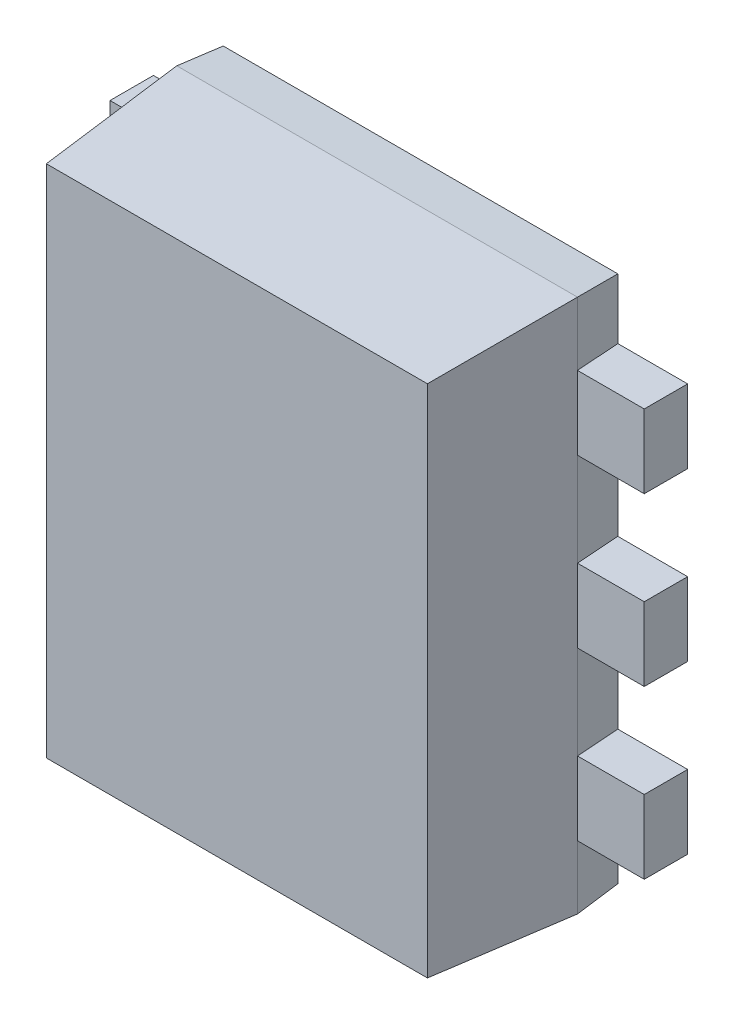
ISO-10303-21;
HEADER;
FILE_DESCRIPTION(('STEP AP214'),'2;1');
FILE_NAME('part.step','',(''),(''),'','','');
FILE_SCHEMA(('AUTOMOTIVE_DESIGN { 1 0 10303 214 1 1 1 1 }'));
ENDSEC;
DATA;
#1=APPLICATION_CONTEXT('core data for automotive mechanical design processes');
#2=APPLICATION_PROTOCOL_DEFINITION('international standard','automotive_design',2000,#1);
#3=PRODUCT_CONTEXT('',#1,'mechanical');
#4=PRODUCT('Part','Part','',(#3));
#5=PRODUCT_RELATED_PRODUCT_CATEGORY('part','',(#4));
#6=PRODUCT_DEFINITION_FORMATION('','',#4);
#7=PRODUCT_DEFINITION_CONTEXT('part definition',#1,'design');
#8=PRODUCT_DEFINITION('design','',#6,#7);
#9=PRODUCT_DEFINITION_SHAPE('','',#8);
#10=(LENGTH_UNIT() NAMED_UNIT(*) SI_UNIT(.MILLI.,.METRE.));
#11=(NAMED_UNIT(*) PLANE_ANGLE_UNIT() SI_UNIT($,.RADIAN.));
#12=(NAMED_UNIT(*) SI_UNIT($,.STERADIAN.) SOLID_ANGLE_UNIT());
#13=UNCERTAINTY_MEASURE_WITH_UNIT(LENGTH_MEASURE(1.E-05),#10,'distance_accuracy_value','');
#14=(GEOMETRIC_REPRESENTATION_CONTEXT(3) GLOBAL_UNCERTAINTY_ASSIGNED_CONTEXT((#13)) GLOBAL_UNIT_ASSIGNED_CONTEXT((#10,
#11,#12)) REPRESENTATION_CONTEXT('',''));
#15=CARTESIAN_POINT('',(0.,0.,0.));
#16=DIRECTION('',(0.,0.,1.));
#17=DIRECTION('',(1.,0.,0.));
#18=AXIS2_PLACEMENT_3D('',#15,#16,#17);
#19=CARTESIAN_POINT('',(0.590909514447,0.39,0.13));
#20=DIRECTION('',(0.,0.,1.));
#21=DIRECTION('',(1.,0.,0.));
#22=AXIS2_PLACEMENT_3D('',#19,#20,#21);
#23=PLANE('',#22);
#24=DIRECTION('',(0.,1.,0.));
#25=VECTOR('',#24,1.);
#26=CARTESIAN_POINT('',(0.6,-0.8,0.13));
#27=LINE('',#26,#25);
#28=CARTESIAN_POINT('',(0.6,0.39,0.13));
#29=VERTEX_POINT('',#28);
#30=CARTESIAN_POINT('',(0.6,0.61,0.13));
#31=VERTEX_POINT('',#30);
#32=EDGE_CURVE('E405',#29,#31,#27,.T.);
#33=ORIENTED_EDGE('',*,*,#32,.F.);
#34=DIRECTION('',(1.,0.,0.));
#35=VECTOR('',#34,1.);
#36=CARTESIAN_POINT('',(0.590909514447,0.39,0.13));
#37=LINE('',#36,#35);
#38=CARTESIAN_POINT('',(0.8,0.39,0.13));
#39=VERTEX_POINT('',#38);
#40=EDGE_CURVE('E415',#29,#39,#37,.T.);
#41=ORIENTED_EDGE('',*,*,#40,.T.);
#42=DIRECTION('',(0.,1.,0.));
#43=VECTOR('',#42,1.);
#44=CARTESIAN_POINT('',(0.8,0.39,0.13));
#45=LINE('',#44,#43);
#46=CARTESIAN_POINT('',(0.8,0.61,0.13));
#47=VERTEX_POINT('',#46);
#48=EDGE_CURVE('E411',#39,#47,#45,.T.);
#49=ORIENTED_EDGE('',*,*,#48,.T.);
#50=DIRECTION('',(1.,0.,0.));
#51=VECTOR('',#50,1.);
#52=CARTESIAN_POINT('',(0.590909514447,0.61,0.13));
#53=LINE('',#52,#51);
#54=EDGE_CURVE('E461',#31,#47,#53,.T.);
#55=ORIENTED_EDGE('',*,*,#54,.F.);
#56=EDGE_LOOP('',(#33,#41,#49,#55));
#57=FACE_BOUND('',#56,.T.);
#58=ADVANCED_FACE('F17',(#57),#23,.T.);
#59=CARTESIAN_POINT('',(0.590909514447,-0.11,0.13));
#60=DIRECTION('',(0.,0.,1.));
#61=DIRECTION('',(1.,0.,0.));
#62=AXIS2_PLACEMENT_3D('',#59,#60,#61);
#63=PLANE('',#62);
#64=DIRECTION('',(0.,1.,0.));
#65=VECTOR('',#64,1.);
#66=CARTESIAN_POINT('',(0.6,-0.8,0.13));
#67=LINE('',#66,#65);
#68=CARTESIAN_POINT('',(0.6,-0.11,0.13));
#69=VERTEX_POINT('',#68);
#70=CARTESIAN_POINT('',(0.6,0.11,0.13));
#71=VERTEX_POINT('',#70);
#72=EDGE_CURVE('E401',#69,#71,#67,.T.);
#73=ORIENTED_EDGE('',*,*,#72,.F.);
#74=DIRECTION('',(1.,0.,0.));
#75=VECTOR('',#74,1.);
#76=CARTESIAN_POINT('',(0.590909514447,-0.11,0.13));
#77=LINE('',#76,#75);
#78=CARTESIAN_POINT('',(0.8,-0.11,0.13));
#79=VERTEX_POINT('',#78);
#80=EDGE_CURVE('E335',#69,#79,#77,.T.);
#81=ORIENTED_EDGE('',*,*,#80,.T.);
#82=DIRECTION('',(0.,1.,0.));
#83=VECTOR('',#82,1.);
#84=CARTESIAN_POINT('',(0.8,-0.11,0.13));
#85=LINE('',#84,#83);
#86=CARTESIAN_POINT('',(0.8,0.11,0.13));
#87=VERTEX_POINT('',#86);
#88=EDGE_CURVE('E571',#79,#87,#85,.T.);
#89=ORIENTED_EDGE('',*,*,#88,.T.);
#90=DIRECTION('',(1.,0.,0.));
#91=VECTOR('',#90,1.);
#92=CARTESIAN_POINT('',(0.590909514447,0.11,0.13));
#93=LINE('',#92,#91);
#94=EDGE_CURVE('E433',#71,#87,#93,.T.);
#95=ORIENTED_EDGE('',*,*,#94,.F.);
#96=EDGE_LOOP('',(#73,#81,#89,#95));
#97=FACE_BOUND('',#96,.T.);
#98=ADVANCED_FACE('F685',(#97),#63,.T.);
#99=CARTESIAN_POINT('',(0.590909514447,-0.61,0.13));
#100=DIRECTION('',(0.,0.,1.));
#101=DIRECTION('',(1.,0.,0.));
#102=AXIS2_PLACEMENT_3D('',#99,#100,#101);
#103=PLANE('',#102);
#104=DIRECTION('',(0.,1.,0.));
#105=VECTOR('',#104,1.);
#106=CARTESIAN_POINT('',(0.6,-0.8,0.13));
#107=LINE('',#106,#105);
#108=CARTESIAN_POINT('',(0.6,-0.61,0.13));
#109=VERTEX_POINT('',#108);
#110=CARTESIAN_POINT('',(0.6,-0.39,0.13));
#111=VERTEX_POINT('',#110);
#112=EDGE_CURVE('E406',#109,#111,#107,.T.);
#113=ORIENTED_EDGE('',*,*,#112,.F.);
#114=DIRECTION('',(1.,0.,0.));
#115=VECTOR('',#114,1.);
#116=CARTESIAN_POINT('',(0.590909514447,-0.61,0.13));
#117=LINE('',#116,#115);
#118=CARTESIAN_POINT('',(0.8,-0.61,0.13));
#119=VERTEX_POINT('',#118);
#120=EDGE_CURVE('E27',#109,#119,#117,.T.);
#121=ORIENTED_EDGE('',*,*,#120,.T.);
#122=DIRECTION('',(0.,1.,0.));
#123=VECTOR('',#122,1.);
#124=CARTESIAN_POINT('',(0.8,-0.61,0.13));
#125=LINE('',#124,#123);
#126=CARTESIAN_POINT('',(0.8,-0.39,0.13));
#127=VERTEX_POINT('',#126);
#128=EDGE_CURVE('E11',#119,#127,#125,.T.);
#129=ORIENTED_EDGE('',*,*,#128,.T.);
#130=DIRECTION('',(1.,0.,0.));
#131=VECTOR('',#130,1.);
#132=CARTESIAN_POINT('',(0.590909514447,-0.39,0.13));
#133=LINE('',#132,#131);
#134=EDGE_CURVE('E469',#111,#127,#133,.T.);
#135=ORIENTED_EDGE('',*,*,#134,.F.);
#136=EDGE_LOOP('',(#113,#121,#129,#135));
#137=FACE_BOUND('',#136,.T.);
#138=ADVANCED_FACE('F776',(#137),#103,.T.);
#139=CARTESIAN_POINT('',(-0.590909514447,-0.39,0.13));
#140=DIRECTION('',(0.,0.,1.));
#141=DIRECTION('',(1.,0.,0.));
#142=AXIS2_PLACEMENT_3D('',#139,#140,#141);
#143=PLANE('',#142);
#144=DIRECTION('',(0.,-1.,0.));
#145=VECTOR('',#144,1.);
#146=CARTESIAN_POINT('',(-0.6,0.8,0.13));
#147=LINE('',#146,#145);
#148=CARTESIAN_POINT('',(-0.6,-0.39,0.13));
#149=VERTEX_POINT('',#148);
#150=CARTESIAN_POINT('',(-0.6,-0.61,0.13));
#151=VERTEX_POINT('',#150);
#152=EDGE_CURVE('E369',#149,#151,#147,.T.);
#153=ORIENTED_EDGE('',*,*,#152,.F.);
#154=DIRECTION('',(-1.,0.,0.));
#155=VECTOR('',#154,1.);
#156=CARTESIAN_POINT('',(-0.590909514447,-0.39,0.13));
#157=LINE('',#156,#155);
#158=CARTESIAN_POINT('',(-0.8,-0.39,0.13));
#159=VERTEX_POINT('',#158);
#160=EDGE_CURVE('E336',#149,#159,#157,.T.);
#161=ORIENTED_EDGE('',*,*,#160,.T.);
#162=DIRECTION('',(0.,-1.,0.));
#163=VECTOR('',#162,1.);
#164=CARTESIAN_POINT('',(-0.8,-0.39,0.13));
#165=LINE('',#164,#163);
#166=CARTESIAN_POINT('',(-0.8,-0.61,0.13));
#167=VERTEX_POINT('',#166);
#168=EDGE_CURVE('E466',#159,#167,#165,.T.);
#169=ORIENTED_EDGE('',*,*,#168,.T.);
#170=DIRECTION('',(-1.,0.,0.));
#171=VECTOR('',#170,1.);
#172=CARTESIAN_POINT('',(-0.590909514447,-0.61,0.13));
#173=LINE('',#172,#171);
#174=EDGE_CURVE('E497',#151,#167,#173,.T.);
#175=ORIENTED_EDGE('',*,*,#174,.F.);
#176=EDGE_LOOP('',(#153,#161,#169,#175));
#177=FACE_BOUND('',#176,.T.);
#178=ADVANCED_FACE('F957',(#177),#143,.T.);
#179=CARTESIAN_POINT('',(-0.590909514447,0.11,0.13));
#180=DIRECTION('',(0.,0.,1.));
#181=DIRECTION('',(1.,0.,0.));
#182=AXIS2_PLACEMENT_3D('',#179,#180,#181);
#183=PLANE('',#182);
#184=DIRECTION('',(0.,-1.,0.));
#185=VECTOR('',#184,1.);
#186=CARTESIAN_POINT('',(-0.6,0.8,0.13));
#187=LINE('',#186,#185);
#188=CARTESIAN_POINT('',(-0.6,0.11,0.13));
#189=VERTEX_POINT('',#188);
#190=CARTESIAN_POINT('',(-0.6,-0.11,0.13));
#191=VERTEX_POINT('',#190);
#192=EDGE_CURVE('E365',#189,#191,#187,.T.);
#193=ORIENTED_EDGE('',*,*,#192,.F.);
#194=DIRECTION('',(-1.,0.,0.));
#195=VECTOR('',#194,1.);
#196=CARTESIAN_POINT('',(-0.590909514447,0.11,0.13));
#197=LINE('',#196,#195);
#198=CARTESIAN_POINT('',(-0.8,0.11,0.13));
#199=VERTEX_POINT('',#198);
#200=EDGE_CURVE('E548',#189,#199,#197,.T.);
#201=ORIENTED_EDGE('',*,*,#200,.T.);
#202=DIRECTION('',(0.,-1.,0.));
#203=VECTOR('',#202,1.);
#204=CARTESIAN_POINT('',(-0.8,0.11,0.13));
#205=LINE('',#204,#203);
#206=CARTESIAN_POINT('',(-0.8,-0.11,0.13));
#207=VERTEX_POINT('',#206);
#208=EDGE_CURVE('E534',#199,#207,#205,.T.);
#209=ORIENTED_EDGE('',*,*,#208,.T.);
#210=DIRECTION('',(-1.,0.,0.));
#211=VECTOR('',#210,1.);
#212=CARTESIAN_POINT('',(-0.590909514447,-0.11,0.13));
#213=LINE('',#212,#211);
#214=EDGE_CURVE('E414',#191,#207,#213,.T.);
#215=ORIENTED_EDGE('',*,*,#214,.F.);
#216=EDGE_LOOP('',(#193,#201,#209,#215));
#217=FACE_BOUND('',#216,.T.);
#218=ADVANCED_FACE('F732',(#217),#183,.T.);
#219=CARTESIAN_POINT('',(-0.590909514447,0.61,0.13));
#220=DIRECTION('',(0.,0.,1.));
#221=DIRECTION('',(1.,0.,0.));
#222=AXIS2_PLACEMENT_3D('',#219,#220,#221);
#223=PLANE('',#222);
#224=DIRECTION('',(0.,-1.,0.));
#225=VECTOR('',#224,1.);
#226=CARTESIAN_POINT('',(-0.6,0.8,0.13));
#227=LINE('',#226,#225);
#228=CARTESIAN_POINT('',(-0.6,0.61,0.13));
#229=VERTEX_POINT('',#228);
#230=CARTESIAN_POINT('',(-0.6,0.39,0.13));
#231=VERTEX_POINT('',#230);
#232=EDGE_CURVE('E370',#229,#231,#227,.T.);
#233=ORIENTED_EDGE('',*,*,#232,.F.);
#234=DIRECTION('',(-1.,0.,0.));
#235=VECTOR('',#234,1.);
#236=CARTESIAN_POINT('',(-0.590909514447,0.61,0.13));
#237=LINE('',#236,#235);
#238=CARTESIAN_POINT('',(-0.8,0.61,0.13));
#239=VERTEX_POINT('',#238);
#240=EDGE_CURVE('E349',#229,#239,#237,.T.);
#241=ORIENTED_EDGE('',*,*,#240,.T.);
#242=DIRECTION('',(0.,-1.,0.));
#243=VECTOR('',#242,1.);
#244=CARTESIAN_POINT('',(-0.8,0.61,0.13));
#245=LINE('',#244,#243);
#246=CARTESIAN_POINT('',(-0.8,0.39,0.13));
#247=VERTEX_POINT('',#246);
#248=EDGE_CURVE('E549',#239,#247,#245,.T.);
#249=ORIENTED_EDGE('',*,*,#248,.T.);
#250=DIRECTION('',(-1.,0.,0.));
#251=VECTOR('',#250,1.);
#252=CARTESIAN_POINT('',(-0.590909514447,0.39,0.13));
#253=LINE('',#252,#251);
#254=EDGE_CURVE('E359',#231,#247,#253,.T.);
#255=ORIENTED_EDGE('',*,*,#254,.F.);
#256=EDGE_LOOP('',(#233,#241,#249,#255));
#257=FACE_BOUND('',#256,.T.);
#258=ADVANCED_FACE('F706',(#257),#223,.T.);
#259=CARTESIAN_POINT('',(-0.6,-0.8,0.13));
#260=DIRECTION('',(0.,-0.99756405025987,0.0697564737434769));
#261=DIRECTION('',(1.,0.,0.));
#262=AXIS2_PLACEMENT_3D('',#259,#260,#261);
#263=PLANE('',#262);
#264=DIRECTION('',(1.,0.,0.));
#265=VECTOR('',#264,1.);
#266=CARTESIAN_POINT('',(-0.6,-0.8,0.13));
#267=LINE('',#266,#265);
#268=CARTESIAN_POINT('',(-0.6,-0.8,0.13));
#269=VERTEX_POINT('',#268);
#270=CARTESIAN_POINT('',(0.6,-0.8,0.13));
#271=VERTEX_POINT('',#270);
#272=EDGE_CURVE('E511',#269,#271,#267,.T.);
#273=ORIENTED_EDGE('',*,*,#272,.T.);
#274=DIRECTION('',(-0.0695873743160207,0.069587374316021,0.995145815783599));
#275=VECTOR('',#274,1.);
#276=CARTESIAN_POINT('',(0.585315369492,-0.785315369492,0.34));
#277=LINE('',#276,#275);
#278=CARTESIAN_POINT('',(0.570630738984,-0.770630738984,0.55));
#279=VERTEX_POINT('',#278);
#280=EDGE_CURVE('E540',#271,#279,#277,.T.);
#281=ORIENTED_EDGE('',*,*,#280,.T.);
#282=DIRECTION('',(1.,0.,0.));
#283=VECTOR('',#282,1.);
#284=CARTESIAN_POINT('',(-0.570630738984,-0.770630738984,0.55));
#285=LINE('',#284,#283);
#286=CARTESIAN_POINT('',(-0.570630738984,-0.770630738984,0.55));
#287=VERTEX_POINT('',#286);
#288=EDGE_CURVE('E353',#287,#279,#285,.T.);
#289=ORIENTED_EDGE('',*,*,#288,.F.);
#290=DIRECTION('',(0.0695873743160207,0.069587374316021,0.995145815783599));
#291=VECTOR('',#290,1.);
#292=CARTESIAN_POINT('',(-0.585315369492,-0.785315369492,0.34));
#293=LINE('',#292,#291);
#294=EDGE_CURVE('E380',#269,#287,#293,.T.);
#295=ORIENTED_EDGE('',*,*,#294,.F.);
#296=EDGE_LOOP('',(#273,#281,#289,#295));
#297=FACE_BOUND('',#296,.T.);
#298=ADVANCED_FACE('F757',(#297),#263,.T.);
#299=CARTESIAN_POINT('',(0.8,-0.61,0.));
#300=DIRECTION('',(1.,0.,0.));
#301=DIRECTION('',(0.,1.,0.));
#302=AXIS2_PLACEMENT_3D('',#299,#300,#301);
#303=PLANE('',#302);
#304=DIRECTION('',(0.,0.,1.));
#305=VECTOR('',#304,1.);
#306=CARTESIAN_POINT('',(0.8,-0.61,0.));
#307=LINE('',#306,#305);
#308=CARTESIAN_POINT('',(0.8,-0.61,0.));
#309=VERTEX_POINT('',#308);
#310=EDGE_CURVE('E583',#309,#119,#307,.T.);
#311=ORIENTED_EDGE('',*,*,#310,.F.);
#312=DIRECTION('',(0.,1.,0.));
#313=VECTOR('',#312,1.);
#314=CARTESIAN_POINT('',(0.8,-0.61,0.));
#315=LINE('',#314,#313);
#316=CARTESIAN_POINT('',(0.8,-0.39,0.));
#317=VERTEX_POINT('',#316);
#318=EDGE_CURVE('E381',#309,#317,#315,.T.);
#319=ORIENTED_EDGE('',*,*,#318,.T.);
#320=DIRECTION('',(0.,0.,1.));
#321=VECTOR('',#320,1.);
#322=CARTESIAN_POINT('',(0.8,-0.39,0.));
#323=LINE('',#322,#321);
#324=EDGE_CURVE('E580',#317,#127,#323,.T.);
#325=ORIENTED_EDGE('',*,*,#324,.T.);
#326=ORIENTED_EDGE('',*,*,#128,.F.);
#327=EDGE_LOOP('',(#311,#319,#325,#326));
#328=FACE_BOUND('',#327,.T.);
#329=ADVANCED_FACE('F782',(#328),#303,.T.);
#330=CARTESIAN_POINT('',(0.590909514447,-0.61,0.));
#331=DIRECTION('',(0.,1.,0.));
#332=DIRECTION('',(1.,0.,0.));
#333=AXIS2_PLACEMENT_3D('',#330,#331,#332);
#334=PLANE('',#333);
#335=ORIENTED_EDGE('',*,*,#310,.T.);
#336=ORIENTED_EDGE('',*,*,#120,.F.);
#337=DIRECTION('',(0.069756473757443,0.,0.997564050258893));
#338=VECTOR('',#337,1.);
#339=CARTESIAN_POINT('',(0.595566963293344,-0.61,0.0666046215547359));
#340=LINE('',#339,#338);
#341=CARTESIAN_POINT('',(0.590909514447,-0.61,0.));
#342=VERTEX_POINT('',#341);
#343=EDGE_CURVE('E515',#342,#109,#340,.T.);
#344=ORIENTED_EDGE('',*,*,#343,.F.);
#345=DIRECTION('',(1.,0.,0.));
#346=VECTOR('',#345,1.);
#347=CARTESIAN_POINT('',(0.590909514447,-0.61,0.));
#348=LINE('',#347,#346);
#349=EDGE_CURVE('E385',#342,#309,#348,.T.);
#350=ORIENTED_EDGE('',*,*,#349,.T.);
#351=EDGE_LOOP('',(#335,#336,#344,#350));
#352=FACE_BOUND('',#351,.T.);
#353=ADVANCED_FACE('F903',(#352),#334,.F.);
#354=CARTESIAN_POINT('',(0.590909514447,-0.39,0.));
#355=DIRECTION('',(0.,1.,0.));
#356=DIRECTION('',(1.,0.,0.));
#357=AXIS2_PLACEMENT_3D('',#354,#355,#356);
#358=PLANE('',#357);
#359=DIRECTION('',(1.,0.,0.));
#360=VECTOR('',#359,1.);
#361=CARTESIAN_POINT('',(0.590909514447,-0.39,0.));
#362=LINE('',#361,#360);
#363=CARTESIAN_POINT('',(0.590909514447,-0.39,0.));
#364=VERTEX_POINT('',#363);
#365=EDGE_CURVE('E386',#364,#317,#362,.T.);
#366=ORIENTED_EDGE('',*,*,#365,.F.);
#367=DIRECTION('',(0.0697564737656201,0.,0.997564050258321));
#368=VECTOR('',#367,1.);
#369=CARTESIAN_POINT('',(0.59567915418225,-0.39,0.0682090260164313));
#370=LINE('',#369,#368);
#371=EDGE_CURVE('E493',#364,#111,#370,.T.);
#372=ORIENTED_EDGE('',*,*,#371,.T.);
#373=ORIENTED_EDGE('',*,*,#134,.T.);
#374=ORIENTED_EDGE('',*,*,#324,.F.);
#375=EDGE_LOOP('',(#366,#372,#373,#374));
#376=FACE_BOUND('',#375,.T.);
#377=ADVANCED_FACE('F677',(#376),#358,.T.);
#378=CARTESIAN_POINT('',(-0.8,-0.39,0.));
#379=DIRECTION('',(-1.,0.,0.));
#380=DIRECTION('',(0.,0.,1.));
#381=AXIS2_PLACEMENT_3D('',#378,#379,#380);
#382=PLANE('',#381);
#383=DIRECTION('',(0.,0.,1.));
#384=VECTOR('',#383,1.);
#385=CARTESIAN_POINT('',(-0.8,-0.39,0.));
#386=LINE('',#385,#384);
#387=CARTESIAN_POINT('',(-0.8,-0.39,0.));
#388=VERTEX_POINT('',#387);
#389=EDGE_CURVE('E432',#388,#159,#386,.T.);
#390=ORIENTED_EDGE('',*,*,#389,.F.);
#391=DIRECTION('',(0.,-1.,0.));
#392=VECTOR('',#391,1.);
#393=CARTESIAN_POINT('',(-0.8,-0.39,0.));
#394=LINE('',#393,#392);
#395=CARTESIAN_POINT('',(-0.8,-0.61,0.));
#396=VERTEX_POINT('',#395);
#397=EDGE_CURVE('E481',#388,#396,#394,.T.);
#398=ORIENTED_EDGE('',*,*,#397,.T.);
#399=DIRECTION('',(0.,0.,1.));
#400=VECTOR('',#399,1.);
#401=CARTESIAN_POINT('',(-0.8,-0.61,0.));
#402=LINE('',#401,#400);
#403=EDGE_CURVE('E470',#396,#167,#402,.T.);
#404=ORIENTED_EDGE('',*,*,#403,.T.);
#405=ORIENTED_EDGE('',*,*,#168,.F.);
#406=EDGE_LOOP('',(#390,#398,#404,#405));
#407=FACE_BOUND('',#406,.T.);
#408=ADVANCED_FACE('F860',(#407),#382,.T.);
#409=CARTESIAN_POINT('',(-0.590909514447,-0.61,0.));
#410=DIRECTION('',(0.,-1.,0.));
#411=DIRECTION('',(-1.,0.,0.));
#412=AXIS2_PLACEMENT_3D('',#409,#410,#411);
#413=PLANE('',#412);
#414=DIRECTION('',(-1.,0.,0.));
#415=VECTOR('',#414,1.);
#416=CARTESIAN_POINT('',(-0.590909514447,-0.61,0.));
#417=LINE('',#416,#415);
#418=CARTESIAN_POINT('',(-0.590909514447,-0.61,0.));
#419=VERTEX_POINT('',#418);
#420=EDGE_CURVE('E477',#419,#396,#417,.T.);
#421=ORIENTED_EDGE('',*,*,#420,.F.);
#422=DIRECTION('',(-0.069756473757443,0.,0.997564050258893));
#423=VECTOR('',#422,1.);
#424=CARTESIAN_POINT('',(-0.595566963293344,-0.61,0.0666046215547359));
#425=LINE('',#424,#423);
#426=EDGE_CURVE('E505',#419,#151,#425,.T.);
#427=ORIENTED_EDGE('',*,*,#426,.T.);
#428=ORIENTED_EDGE('',*,*,#174,.T.);
#429=ORIENTED_EDGE('',*,*,#403,.F.);
#430=EDGE_LOOP('',(#421,#427,#428,#429));
#431=FACE_BOUND('',#430,.T.);
#432=ADVANCED_FACE('F748',(#431),#413,.T.);
#433=CARTESIAN_POINT('',(0.8,-0.11,0.));
#434=DIRECTION('',(1.,0.,0.));
#435=DIRECTION('',(0.,1.,0.));
#436=AXIS2_PLACEMENT_3D('',#433,#434,#435);
#437=PLANE('',#436);
#438=DIRECTION('',(0.,0.,1.));
#439=VECTOR('',#438,1.);
#440=CARTESIAN_POINT('',(0.8,-0.11,0.));
#441=LINE('',#440,#439);
#442=CARTESIAN_POINT('',(0.8,-0.11,0.));
#443=VERTEX_POINT('',#442);
#444=EDGE_CURVE('E331',#443,#79,#441,.T.);
#445=ORIENTED_EDGE('',*,*,#444,.F.);
#446=DIRECTION('',(0.,1.,0.));
#447=VECTOR('',#446,1.);
#448=CARTESIAN_POINT('',(0.8,-0.11,0.));
#449=LINE('',#448,#447);
#450=CARTESIAN_POINT('',(0.8,0.11,0.));
#451=VERTEX_POINT('',#450);
#452=EDGE_CURVE('E290',#443,#451,#449,.T.);
#453=ORIENTED_EDGE('',*,*,#452,.T.);
#454=DIRECTION('',(0.,0.,1.));
#455=VECTOR('',#454,1.);
#456=CARTESIAN_POINT('',(0.8,0.11,0.));
#457=LINE('',#456,#455);
#458=EDGE_CURVE('E284',#451,#87,#457,.T.);
#459=ORIENTED_EDGE('',*,*,#458,.T.);
#460=ORIENTED_EDGE('',*,*,#88,.F.);
#461=EDGE_LOOP('',(#445,#453,#459,#460));
#462=FACE_BOUND('',#461,.T.);
#463=ADVANCED_FACE('F994',(#462),#437,.T.);
#464=CARTESIAN_POINT('',(0.590909514447,-0.11,0.));
#465=DIRECTION('',(0.,1.,0.));
#466=DIRECTION('',(1.,0.,0.));
#467=AXIS2_PLACEMENT_3D('',#464,#465,#466);
#468=PLANE('',#467);
#469=ORIENTED_EDGE('',*,*,#444,.T.);
#470=ORIENTED_EDGE('',*,*,#80,.F.);
#471=DIRECTION('',(0.0697564737415825,0.,0.997564050260002));
#472=VECTOR('',#471,1.);
#473=CARTESIAN_POINT('',(0.595454757186813,-0.11,0.064999999474755));
#474=LINE('',#473,#472);
#475=CARTESIAN_POINT('',(0.590909514447,-0.11,0.));
#476=VERTEX_POINT('',#475);
#477=EDGE_CURVE('E506',#476,#69,#474,.T.);
#478=ORIENTED_EDGE('',*,*,#477,.F.);
#479=DIRECTION('',(1.,0.,0.));
#480=VECTOR('',#479,1.);
#481=CARTESIAN_POINT('',(0.590909514447,-0.11,0.));
#482=LINE('',#481,#480);
#483=EDGE_CURVE('E473',#476,#443,#482,.T.);
#484=ORIENTED_EDGE('',*,*,#483,.T.);
#485=EDGE_LOOP('',(#469,#470,#478,#484));
#486=FACE_BOUND('',#485,.T.);
#487=ADVANCED_FACE('F682',(#486),#468,.F.);
#488=CARTESIAN_POINT('',(-0.590909514447,-0.39,0.));
#489=DIRECTION('',(0.,-1.,0.));
#490=DIRECTION('',(-1.,0.,0.));
#491=AXIS2_PLACEMENT_3D('',#488,#489,#490);
#492=PLANE('',#491);
#493=ORIENTED_EDGE('',*,*,#389,.T.);
#494=ORIENTED_EDGE('',*,*,#160,.F.);
#495=DIRECTION('',(-0.0697564737656201,0.,0.997564050258321));
#496=VECTOR('',#495,1.);
#497=CARTESIAN_POINT('',(-0.59567915418225,-0.39,0.0682090260164313));
#498=LINE('',#497,#496);
#499=CARTESIAN_POINT('',(-0.590909514447,-0.39,0.));
#500=VERTEX_POINT('',#499);
#501=EDGE_CURVE('E464',#500,#149,#498,.T.);
#502=ORIENTED_EDGE('',*,*,#501,.F.);
#503=DIRECTION('',(-1.,0.,0.));
#504=VECTOR('',#503,1.);
#505=CARTESIAN_POINT('',(-0.590909514447,-0.39,0.));
#506=LINE('',#505,#504);
#507=EDGE_CURVE('E485',#500,#388,#506,.T.);
#508=ORIENTED_EDGE('',*,*,#507,.T.);
#509=EDGE_LOOP('',(#493,#494,#502,#508));
#510=FACE_BOUND('',#509,.T.);
#511=ADVANCED_FACE('F1059',(#510),#492,.F.);
#512=CARTESIAN_POINT('',(0.590909514447,0.11,0.));
#513=DIRECTION('',(0.,1.,0.));
#514=DIRECTION('',(1.,0.,0.));
#515=AXIS2_PLACEMENT_3D('',#512,#513,#514);
#516=PLANE('',#515);
#517=DIRECTION('',(1.,0.,0.));
#518=VECTOR('',#517,1.);
#519=CARTESIAN_POINT('',(0.590909514447,0.11,0.));
#520=LINE('',#519,#518);
#521=CARTESIAN_POINT('',(0.590909514447,0.11,0.));
#522=VERTEX_POINT('',#521);
#523=EDGE_CURVE('E278',#522,#451,#520,.T.);
#524=ORIENTED_EDGE('',*,*,#523,.F.);
#525=DIRECTION('',(0.0697564737415825,0.,0.997564050260002));
#526=VECTOR('',#525,1.);
#527=CARTESIAN_POINT('',(0.595454757186813,0.11,0.064999999474755));
#528=LINE('',#527,#526);
#529=EDGE_CURVE('E282',#522,#71,#528,.T.);
#530=ORIENTED_EDGE('',*,*,#529,.T.);
#531=ORIENTED_EDGE('',*,*,#94,.T.);
#532=ORIENTED_EDGE('',*,*,#458,.F.);
#533=EDGE_LOOP('',(#524,#530,#531,#532));
#534=FACE_BOUND('',#533,.T.);
#535=ADVANCED_FACE('F280',(#534),#516,.T.);
#536=CARTESIAN_POINT('',(-0.8,0.11,0.));
#537=DIRECTION('',(-1.,0.,0.));
#538=DIRECTION('',(0.,0.,1.));
#539=AXIS2_PLACEMENT_3D('',#536,#537,#538);
#540=PLANE('',#539);
#541=DIRECTION('',(0.,0.,1.));
#542=VECTOR('',#541,1.);
#543=CARTESIAN_POINT('',(-0.8,0.11,0.));
#544=LINE('',#543,#542);
#545=CARTESIAN_POINT('',(-0.8,0.11,0.));
#546=VERTEX_POINT('',#545);
#547=EDGE_CURVE('E544',#546,#199,#544,.T.);
#548=ORIENTED_EDGE('',*,*,#547,.F.);
#549=DIRECTION('',(0.,-1.,0.));
#550=VECTOR('',#549,1.);
#551=CARTESIAN_POINT('',(-0.8,0.11,0.));
#552=LINE('',#551,#550);
#553=CARTESIAN_POINT('',(-0.8,-0.11,0.));
#554=VERTEX_POINT('',#553);
#555=EDGE_CURVE('E443',#546,#554,#552,.T.);
#556=ORIENTED_EDGE('',*,*,#555,.T.);
#557=DIRECTION('',(0.,0.,1.));
#558=VECTOR('',#557,1.);
#559=CARTESIAN_POINT('',(-0.8,-0.11,0.));
#560=LINE('',#559,#558);
#561=EDGE_CURVE('E324',#554,#207,#560,.T.);
#562=ORIENTED_EDGE('',*,*,#561,.T.);
#563=ORIENTED_EDGE('',*,*,#208,.F.);
#564=EDGE_LOOP('',(#548,#556,#562,#563));
#565=FACE_BOUND('',#564,.T.);
#566=ADVANCED_FACE('F1114',(#565),#540,.T.);
#567=CARTESIAN_POINT('',(-0.590909514447,-0.11,0.));
#568=DIRECTION('',(0.,-1.,0.));
#569=DIRECTION('',(-1.,0.,0.));
#570=AXIS2_PLACEMENT_3D('',#567,#568,#569);
#571=PLANE('',#570);
#572=DIRECTION('',(-1.,0.,0.));
#573=VECTOR('',#572,1.);
#574=CARTESIAN_POINT('',(-0.590909514447,-0.11,0.));
#575=LINE('',#574,#573);
#576=CARTESIAN_POINT('',(-0.590909514447,-0.11,0.));
#577=VERTEX_POINT('',#576);
#578=EDGE_CURVE('E439',#577,#554,#575,.T.);
#579=ORIENTED_EDGE('',*,*,#578,.F.);
#580=DIRECTION('',(-0.0697564737415825,0.,0.997564050260002));
#581=VECTOR('',#580,1.);
#582=CARTESIAN_POINT('',(-0.595454757186813,-0.11,0.064999999474755));
#583=LINE('',#582,#581);
#584=EDGE_CURVE('E457',#577,#191,#583,.T.);
#585=ORIENTED_EDGE('',*,*,#584,.T.);
#586=ORIENTED_EDGE('',*,*,#214,.T.);
#587=ORIENTED_EDGE('',*,*,#561,.F.);
#588=EDGE_LOOP('',(#579,#585,#586,#587));
#589=FACE_BOUND('',#588,.T.);
#590=ADVANCED_FACE('F736',(#589),#571,.T.);
#591=CARTESIAN_POINT('',(0.8,0.39,0.));
#592=DIRECTION('',(1.,0.,0.));
#593=DIRECTION('',(0.,1.,0.));
#594=AXIS2_PLACEMENT_3D('',#591,#592,#593);
#595=PLANE('',#594);
#596=DIRECTION('',(0.,0.,1.));
#597=VECTOR('',#596,1.);
#598=CARTESIAN_POINT('',(0.8,0.39,0.));
#599=LINE('',#598,#597);
#600=CARTESIAN_POINT('',(0.8,0.39,0.));
#601=VERTEX_POINT('',#600);
#602=EDGE_CURVE('E553',#601,#39,#599,.T.);
#603=ORIENTED_EDGE('',*,*,#602,.F.);
#604=DIRECTION('',(0.,1.,0.));
#605=VECTOR('',#604,1.);
#606=CARTESIAN_POINT('',(0.8,0.39,0.));
#607=LINE('',#606,#605);
#608=CARTESIAN_POINT('',(0.8,0.61,0.));
#609=VERTEX_POINT('',#608);
#610=EDGE_CURVE('E429',#601,#609,#607,.T.);
#611=ORIENTED_EDGE('',*,*,#610,.T.);
#612=DIRECTION('',(0.,0.,1.));
#613=VECTOR('',#612,1.);
#614=CARTESIAN_POINT('',(0.8,0.61,0.));
#615=LINE('',#614,#613);
#616=EDGE_CURVE('E364',#609,#47,#615,.T.);
#617=ORIENTED_EDGE('',*,*,#616,.T.);
#618=ORIENTED_EDGE('',*,*,#48,.F.);
#619=EDGE_LOOP('',(#603,#611,#617,#618));
#620=FACE_BOUND('',#619,.T.);
#621=ADVANCED_FACE('F978',(#620),#595,.T.);
#622=CARTESIAN_POINT('',(0.590909514447,0.39,0.));
#623=DIRECTION('',(0.,1.,0.));
#624=DIRECTION('',(1.,0.,0.));
#625=AXIS2_PLACEMENT_3D('',#622,#623,#624);
#626=PLANE('',#625);
#627=ORIENTED_EDGE('',*,*,#602,.T.);
#628=ORIENTED_EDGE('',*,*,#40,.F.);
#629=DIRECTION('',(0.0697564737656201,0.,0.997564050258321));
#630=VECTOR('',#629,1.);
#631=CARTESIAN_POINT('',(0.59567915418225,0.39,0.0682090260164313));
#632=LINE('',#631,#630);
#633=CARTESIAN_POINT('',(0.590909514447,0.39,0.));
#634=VERTEX_POINT('',#633);
#635=EDGE_CURVE('E302',#634,#29,#632,.T.);
#636=ORIENTED_EDGE('',*,*,#635,.F.);
#637=DIRECTION('',(1.,0.,0.));
#638=VECTOR('',#637,1.);
#639=CARTESIAN_POINT('',(0.590909514447,0.39,0.));
#640=LINE('',#639,#638);
#641=EDGE_CURVE('E309',#634,#601,#640,.T.);
#642=ORIENTED_EDGE('',*,*,#641,.T.);
#643=EDGE_LOOP('',(#627,#628,#636,#642));
#644=FACE_BOUND('',#643,.T.);
#645=ADVANCED_FACE('F688',(#644),#626,.F.);
#646=CARTESIAN_POINT('',(-0.590909514447,0.11,0.));
#647=DIRECTION('',(0.,-1.,0.));
#648=DIRECTION('',(-1.,0.,0.));
#649=AXIS2_PLACEMENT_3D('',#646,#647,#648);
#650=PLANE('',#649);
#651=ORIENTED_EDGE('',*,*,#547,.T.);
#652=ORIENTED_EDGE('',*,*,#200,.F.);
#653=DIRECTION('',(-0.0697564737415825,0.,0.997564050260002));
#654=VECTOR('',#653,1.);
#655=CARTESIAN_POINT('',(-0.595454757186813,0.11,0.064999999474755));
#656=LINE('',#655,#654);
#657=CARTESIAN_POINT('',(-0.590909514447,0.11,0.));
#658=VERTEX_POINT('',#657);
#659=EDGE_CURVE('E425',#658,#189,#656,.T.);
#660=ORIENTED_EDGE('',*,*,#659,.F.);
#661=DIRECTION('',(-1.,0.,0.));
#662=VECTOR('',#661,1.);
#663=CARTESIAN_POINT('',(-0.590909514447,0.11,0.));
#664=LINE('',#663,#662);
#665=EDGE_CURVE('E303',#658,#546,#664,.T.);
#666=ORIENTED_EDGE('',*,*,#665,.T.);
#667=EDGE_LOOP('',(#651,#652,#660,#666));
#668=FACE_BOUND('',#667,.T.);
#669=ADVANCED_FACE('F730',(#668),#650,.F.);
#670=CARTESIAN_POINT('',(-0.8,0.61,0.));
#671=DIRECTION('',(-1.,0.,0.));
#672=DIRECTION('',(0.,0.,1.));
#673=AXIS2_PLACEMENT_3D('',#670,#671,#672);
#674=PLANE('',#673);
#675=DIRECTION('',(0.,0.,1.));
#676=VECTOR('',#675,1.);
#677=CARTESIAN_POINT('',(-0.8,0.61,0.));
#678=LINE('',#677,#676);
#679=CARTESIAN_POINT('',(-0.8,0.61,0.));
#680=VERTEX_POINT('',#679);
#681=EDGE_CURVE('E354',#680,#239,#678,.T.);
#682=ORIENTED_EDGE('',*,*,#681,.F.);
#683=DIRECTION('',(0.,-1.,0.));
#684=VECTOR('',#683,1.);
#685=CARTESIAN_POINT('',(-0.8,0.61,0.));
#686=LINE('',#685,#684);
#687=CARTESIAN_POINT('',(-0.8,0.39,0.));
#688=VERTEX_POINT('',#687);
#689=EDGE_CURVE('E400',#680,#688,#686,.T.);
#690=ORIENTED_EDGE('',*,*,#689,.T.);
#691=DIRECTION('',(0.,0.,1.));
#692=VECTOR('',#691,1.);
#693=CARTESIAN_POINT('',(-0.8,0.39,0.));
#694=LINE('',#693,#692);
#695=EDGE_CURVE('E363',#688,#247,#694,.T.);
#696=ORIENTED_EDGE('',*,*,#695,.T.);
#697=ORIENTED_EDGE('',*,*,#248,.F.);
#698=EDGE_LOOP('',(#682,#690,#696,#697));
#699=FACE_BOUND('',#698,.T.);
#700=ADVANCED_FACE('F708',(#699),#674,.T.);
#701=CARTESIAN_POINT('',(-0.590909514447,0.39,0.));
#702=DIRECTION('',(0.,-1.,0.));
#703=DIRECTION('',(-1.,0.,0.));
#704=AXIS2_PLACEMENT_3D('',#701,#702,#703);
#705=PLANE('',#704);
#706=DIRECTION('',(-1.,0.,0.));
#707=VECTOR('',#706,1.);
#708=CARTESIAN_POINT('',(-0.590909514447,0.39,0.));
#709=LINE('',#708,#707);
#710=CARTESIAN_POINT('',(-0.590909514447,0.39,0.));
#711=VERTEX_POINT('',#710);
#712=EDGE_CURVE('E390',#711,#688,#709,.T.);
#713=ORIENTED_EDGE('',*,*,#712,.F.);
#714=DIRECTION('',(-0.0697564737656201,0.,0.997564050258321));
#715=VECTOR('',#714,1.);
#716=CARTESIAN_POINT('',(-0.59567915418225,0.39,0.0682090260164344));
#717=LINE('',#716,#715);
#718=EDGE_CURVE('E419',#711,#231,#717,.T.);
#719=ORIENTED_EDGE('',*,*,#718,.T.);
#720=ORIENTED_EDGE('',*,*,#254,.T.);
#721=ORIENTED_EDGE('',*,*,#695,.F.);
#722=EDGE_LOOP('',(#713,#719,#720,#721));
#723=FACE_BOUND('',#722,.T.);
#724=ADVANCED_FACE('F712',(#723),#705,.T.);
#725=CARTESIAN_POINT('',(0.590909514447,0.61,0.));
#726=DIRECTION('',(0.,1.,0.));
#727=DIRECTION('',(1.,0.,0.));
#728=AXIS2_PLACEMENT_3D('',#725,#726,#727);
#729=PLANE('',#728);
#730=DIRECTION('',(1.,0.,0.));
#731=VECTOR('',#730,1.);
#732=CARTESIAN_POINT('',(0.590909514447,0.61,0.));
#733=LINE('',#732,#731);
#734=CARTESIAN_POINT('',(0.590909514447,0.61,0.));
#735=VERTEX_POINT('',#734);
#736=EDGE_CURVE('E424',#735,#609,#733,.T.);
#737=ORIENTED_EDGE('',*,*,#736,.F.);
#738=DIRECTION('',(0.069756473757443,0.,0.997564050258893));
#739=VECTOR('',#738,1.);
#740=CARTESIAN_POINT('',(0.595566963293344,0.61,0.0666046215547359));
#741=LINE('',#740,#739);
#742=EDGE_CURVE('E391',#735,#31,#741,.T.);
#743=ORIENTED_EDGE('',*,*,#742,.T.);
#744=ORIENTED_EDGE('',*,*,#54,.T.);
#745=ORIENTED_EDGE('',*,*,#616,.F.);
#746=EDGE_LOOP('',(#737,#743,#744,#745));
#747=FACE_BOUND('',#746,.T.);
#748=ADVANCED_FACE('F691',(#747),#729,.T.);
#749=CARTESIAN_POINT('',(0.6,-0.8,0.13));
#750=DIRECTION('',(0.99756405025987,0.,0.0697564737434767));
#751=DIRECTION('',(0.,1.,0.));
#752=AXIS2_PLACEMENT_3D('',#749,#750,#751);
#753=PLANE('',#752);
#754=DIRECTION('',(0.,1.,0.));
#755=VECTOR('',#754,1.);
#756=CARTESIAN_POINT('',(0.6,-0.8,0.13));
#757=LINE('',#756,#755);
#758=EDGE_CURVE('E489',#271,#109,#757,.T.);
#759=ORIENTED_EDGE('',*,*,#758,.T.);
#760=ORIENTED_EDGE('',*,*,#112,.T.);
#761=DIRECTION('',(0.,1.,0.));
#762=VECTOR('',#761,1.);
#763=CARTESIAN_POINT('',(0.6,-0.8,0.13));
#764=LINE('',#763,#762);
#765=EDGE_CURVE('E501',#111,#69,#764,.T.);
#766=ORIENTED_EDGE('',*,*,#765,.T.);
#767=ORIENTED_EDGE('',*,*,#72,.T.);
#768=DIRECTION('',(0.,1.,0.));
#769=VECTOR('',#768,1.);
#770=CARTESIAN_POINT('',(0.6,-0.8,0.13));
#771=LINE('',#770,#769);
#772=EDGE_CURVE('E300',#71,#29,#771,.T.);
#773=ORIENTED_EDGE('',*,*,#772,.T.);
#774=ORIENTED_EDGE('',*,*,#32,.T.);
#775=DIRECTION('',(0.,1.,0.));
#776=VECTOR('',#775,1.);
#777=CARTESIAN_POINT('',(0.6,-0.8,0.13));
#778=LINE('',#777,#776);
#779=CARTESIAN_POINT('',(0.6,0.8,0.13));
#780=VERTEX_POINT('',#779);
#781=EDGE_CURVE('E387',#31,#780,#778,.T.);
#782=ORIENTED_EDGE('',*,*,#781,.T.);
#783=DIRECTION('',(-0.0695873743160207,-0.069587374316021,0.995145815783599));
#784=VECTOR('',#783,1.);
#785=CARTESIAN_POINT('',(0.585315369492,0.785315369492,0.34));
#786=LINE('',#785,#784);
#787=CARTESIAN_POINT('',(0.570630738984,0.770630738984,0.55));
#788=VERTEX_POINT('',#787);
#789=EDGE_CURVE('E396',#780,#788,#786,.T.);
#790=ORIENTED_EDGE('',*,*,#789,.T.);
#791=DIRECTION('',(0.,1.,0.));
#792=VECTOR('',#791,1.);
#793=CARTESIAN_POINT('',(0.570630738984,-0.770630738984,0.55));
#794=LINE('',#793,#792);
#795=EDGE_CURVE('E531',#279,#788,#794,.T.);
#796=ORIENTED_EDGE('',*,*,#795,.F.);
#797=ORIENTED_EDGE('',*,*,#280,.F.);
#798=EDGE_LOOP('',(#759,#760,#766,#767,#773,#774,#782,#790,#796,#797));
#799=FACE_BOUND('',#798,.T.);
#800=ADVANCED_FACE('F670',(#799),#753,.T.);
#801=CARTESIAN_POINT('',(-0.570630738984,0.770630738984,0.55));
#802=DIRECTION('',(0.,0.,-1.));
#803=DIRECTION('',(0.,-1.,0.));
#804=AXIS2_PLACEMENT_3D('',#801,#802,#803);
#805=PLANE('',#804);
#806=DIRECTION('',(0.,-1.,0.));
#807=VECTOR('',#806,1.);
#808=CARTESIAN_POINT('',(-0.570630738984,0.770630738984,0.55));
#809=LINE('',#808,#807);
#810=CARTESIAN_POINT('',(-0.570630738984,0.770630738984,0.55));
#811=VERTEX_POINT('',#810);
#812=EDGE_CURVE('E376',#811,#287,#809,.T.);
#813=ORIENTED_EDGE('',*,*,#812,.T.);
#814=ORIENTED_EDGE('',*,*,#288,.T.);
#815=ORIENTED_EDGE('',*,*,#795,.T.);
#816=DIRECTION('',(-1.,0.,0.));
#817=VECTOR('',#816,1.);
#818=CARTESIAN_POINT('',(0.570630738984,0.770630738984,0.55));
#819=LINE('',#818,#817);
#820=EDGE_CURVE('E392',#788,#811,#819,.T.);
#821=ORIENTED_EDGE('',*,*,#820,.T.);
#822=EDGE_LOOP('',(#813,#814,#815,#821));
#823=FACE_BOUND('',#822,.T.);
#824=ADVANCED_FACE('F761',(#823),#805,.F.);
#825=CARTESIAN_POINT('',(-0.590909514447,0.61,0.));
#826=DIRECTION('',(0.,-1.,0.));
#827=DIRECTION('',(-1.,0.,0.));
#828=AXIS2_PLACEMENT_3D('',#825,#826,#827);
#829=PLANE('',#828);
#830=ORIENTED_EDGE('',*,*,#681,.T.);
#831=ORIENTED_EDGE('',*,*,#240,.F.);
#832=DIRECTION('',(-0.069756473757443,0.,0.997564050258893));
#833=VECTOR('',#832,1.);
#834=CARTESIAN_POINT('',(-0.595566963293344,0.61,0.0666046215547359));
#835=LINE('',#834,#833);
#836=CARTESIAN_POINT('',(-0.590909514447,0.61,0.));
#837=VERTEX_POINT('',#836);
#838=EDGE_CURVE('E358',#837,#229,#835,.T.);
#839=ORIENTED_EDGE('',*,*,#838,.F.);
#840=DIRECTION('',(-1.,0.,0.));
#841=VECTOR('',#840,1.);
#842=CARTESIAN_POINT('',(-0.590909514447,0.61,0.));
#843=LINE('',#842,#841);
#844=EDGE_CURVE('E410',#837,#680,#843,.T.);
#845=ORIENTED_EDGE('',*,*,#844,.T.);
#846=EDGE_LOOP('',(#830,#831,#839,#845));
#847=FACE_BOUND('',#846,.T.);
#848=ADVANCED_FACE('F727',(#847),#829,.F.);
#849=CARTESIAN_POINT('',(-0.6,0.8,0.13));
#850=DIRECTION('',(-0.99756405025987,0.,0.0697564737434767));
#851=DIRECTION('',(0.,-1.,0.));
#852=AXIS2_PLACEMENT_3D('',#849,#850,#851);
#853=PLANE('',#852);
#854=DIRECTION('',(0.,-1.,0.));
#855=VECTOR('',#854,1.);
#856=CARTESIAN_POINT('',(-0.6,0.8,0.13));
#857=LINE('',#856,#855);
#858=CARTESIAN_POINT('',(-0.6,0.8,0.13));
#859=VERTEX_POINT('',#858);
#860=EDGE_CURVE('E371',#859,#229,#857,.T.);
#861=ORIENTED_EDGE('',*,*,#860,.T.);
#862=ORIENTED_EDGE('',*,*,#232,.T.);
#863=DIRECTION('',(0.,-1.,0.));
#864=VECTOR('',#863,1.);
#865=CARTESIAN_POINT('',(-0.6,0.8,0.13));
#866=LINE('',#865,#864);
#867=EDGE_CURVE('E420',#231,#189,#866,.T.);
#868=ORIENTED_EDGE('',*,*,#867,.T.);
#869=ORIENTED_EDGE('',*,*,#192,.T.);
#870=DIRECTION('',(0.,-1.,0.));
#871=VECTOR('',#870,1.);
#872=CARTESIAN_POINT('',(-0.6,0.8,0.13));
#873=LINE('',#872,#871);
#874=EDGE_CURVE('E291',#191,#149,#873,.T.);
#875=ORIENTED_EDGE('',*,*,#874,.T.);
#876=ORIENTED_EDGE('',*,*,#152,.T.);
#877=DIRECTION('',(0.,-1.,0.));
#878=VECTOR('',#877,1.);
#879=CARTESIAN_POINT('',(-0.6,0.8,0.13));
#880=LINE('',#879,#878);
#881=EDGE_CURVE('E447',#151,#269,#880,.T.);
#882=ORIENTED_EDGE('',*,*,#881,.T.);
#883=ORIENTED_EDGE('',*,*,#294,.T.);
#884=ORIENTED_EDGE('',*,*,#812,.F.);
#885=DIRECTION('',(0.0695873743160207,-0.069587374316021,0.995145815783599));
#886=VECTOR('',#885,1.);
#887=CARTESIAN_POINT('',(-0.585315369492,0.785315369492,0.34));
#888=LINE('',#887,#886);
#889=EDGE_CURVE('E375',#859,#811,#888,.T.);
#890=ORIENTED_EDGE('',*,*,#889,.F.);
#891=EDGE_LOOP('',(#861,#862,#868,#869,#875,#876,#882,#883,#884,#890));
#892=FACE_BOUND('',#891,.T.);
#893=ADVANCED_FACE('F719',(#892),#853,.T.);
#894=CARTESIAN_POINT('',(0.590909514447,-0.790909514447,0.));
#895=DIRECTION('',(0.997564050259641,0.,-0.0697564737467491));
#896=DIRECTION('',(0.,1.,0.));
#897=AXIS2_PLACEMENT_3D('',#894,#895,#896);
#898=PLANE('',#897);
#899=DIRECTION('',(0.0695873743192694,-0.0695873743192702,0.995145815783144));
#900=VECTOR('',#899,1.);
#901=CARTESIAN_POINT('',(0.5954547572235,-0.7954547572235,0.065));
#902=LINE('',#901,#900);
#903=CARTESIAN_POINT('',(0.590909514447,-0.790909514447,0.));
#904=VERTEX_POINT('',#903);
#905=EDGE_CURVE('E510',#904,#271,#902,.T.);
#906=ORIENTED_EDGE('',*,*,#905,.F.);
#907=DIRECTION('',(0.,1.,0.));
#908=VECTOR('',#907,1.);
#909=CARTESIAN_POINT('',(0.590909514447,-0.790909514447,0.));
#910=LINE('',#909,#908);
#911=EDGE_CURVE('E318',#904,#342,#910,.T.);
#912=ORIENTED_EDGE('',*,*,#911,.T.);
#913=ORIENTED_EDGE('',*,*,#343,.T.);
#914=ORIENTED_EDGE('',*,*,#758,.F.);
#915=EDGE_LOOP('',(#906,#912,#913,#914));
#916=FACE_BOUND('',#915,.T.);
#917=ADVANCED_FACE('F787',(#916),#898,.T.);
#918=CARTESIAN_POINT('',(-0.590909514447,-0.790909514447,0.));
#919=DIRECTION('',(0.,-0.997564050259641,-0.0697564737467499));
#920=DIRECTION('',(1.,0.,0.));
#921=AXIS2_PLACEMENT_3D('',#918,#919,#920);
#922=PLANE('',#921);
#923=DIRECTION('',(1.,0.,0.));
#924=VECTOR('',#923,1.);
#925=CARTESIAN_POINT('',(-0.590909514447,-0.790909514447,0.));
#926=LINE('',#925,#924);
#927=CARTESIAN_POINT('',(-0.590909514447,-0.790909514447,0.));
#928=VERTEX_POINT('',#927);
#929=EDGE_CURVE('E330',#928,#904,#926,.T.);
#930=ORIENTED_EDGE('',*,*,#929,.T.);
#931=ORIENTED_EDGE('',*,*,#905,.T.);
#932=ORIENTED_EDGE('',*,*,#272,.F.);
#933=DIRECTION('',(-0.0695873743192694,-0.0695873743192702,0.995145815783144));
#934=VECTOR('',#933,1.);
#935=CARTESIAN_POINT('',(-0.5954547572235,-0.7954547572235,0.065));
#936=LINE('',#935,#934);
#937=EDGE_CURVE('E451',#928,#269,#936,.T.);
#938=ORIENTED_EDGE('',*,*,#937,.F.);
#939=EDGE_LOOP('',(#930,#931,#932,#938));
#940=FACE_BOUND('',#939,.T.);
#941=ADVANCED_FACE('F754',(#940),#922,.T.);
#942=CARTESIAN_POINT('',(-0.590909514447,0.790909514447,0.));
#943=DIRECTION('',(-0.997564050259641,0.,-0.0697564737467491));
#944=DIRECTION('',(0.,-1.,0.));
#945=AXIS2_PLACEMENT_3D('',#942,#943,#944);
#946=PLANE('',#945);
#947=ORIENTED_EDGE('',*,*,#426,.F.);
#948=DIRECTION('',(0.,-1.,0.));
#949=VECTOR('',#948,1.);
#950=CARTESIAN_POINT('',(-0.590909514447,0.790909514447,0.));
#951=LINE('',#950,#949);
#952=EDGE_CURVE('E342',#419,#928,#951,.T.);
#953=ORIENTED_EDGE('',*,*,#952,.T.);
#954=ORIENTED_EDGE('',*,*,#937,.T.);
#955=ORIENTED_EDGE('',*,*,#881,.F.);
#956=EDGE_LOOP('',(#947,#953,#954,#955));
#957=FACE_BOUND('',#956,.T.);
#958=ADVANCED_FACE('F745',(#957),#946,.T.);
#959=CARTESIAN_POINT('',(0.590909514447,-0.790909514447,0.));
#960=DIRECTION('',(0.997564050259641,0.,-0.0697564737467491));
#961=DIRECTION('',(0.,1.,0.));
#962=AXIS2_PLACEMENT_3D('',#959,#960,#961);
#963=PLANE('',#962);
#964=ORIENTED_EDGE('',*,*,#371,.F.);
#965=DIRECTION('',(0.,1.,0.));
#966=VECTOR('',#965,1.);
#967=CARTESIAN_POINT('',(0.590909514447,-0.790909514447,0.));
#968=LINE('',#967,#966);
#969=EDGE_CURVE('E311',#364,#476,#968,.T.);
#970=ORIENTED_EDGE('',*,*,#969,.T.);
#971=ORIENTED_EDGE('',*,*,#477,.T.);
#972=ORIENTED_EDGE('',*,*,#765,.F.);
#973=EDGE_LOOP('',(#964,#970,#971,#972));
#974=FACE_BOUND('',#973,.T.);
#975=ADVANCED_FACE('F674',(#974),#963,.T.);
#976=CARTESIAN_POINT('',(-0.590909514447,0.790909514447,0.));
#977=DIRECTION('',(-0.997564050259641,0.,-0.0697564737467491));
#978=DIRECTION('',(0.,-1.,0.));
#979=AXIS2_PLACEMENT_3D('',#976,#977,#978);
#980=PLANE('',#979);
#981=ORIENTED_EDGE('',*,*,#584,.F.);
#982=DIRECTION('',(0.,-1.,0.));
#983=VECTOR('',#982,1.);
#984=CARTESIAN_POINT('',(-0.590909514447,0.790909514447,0.));
#985=LINE('',#984,#983);
#986=EDGE_CURVE('E337',#577,#500,#985,.T.);
#987=ORIENTED_EDGE('',*,*,#986,.T.);
#988=ORIENTED_EDGE('',*,*,#501,.T.);
#989=ORIENTED_EDGE('',*,*,#874,.F.);
#990=EDGE_LOOP('',(#981,#987,#988,#989));
#991=FACE_BOUND('',#990,.T.);
#992=ADVANCED_FACE('F739',(#991),#980,.T.);
#993=CARTESIAN_POINT('',(0.590909514447,-0.790909514447,0.));
#994=DIRECTION('',(0.997564050259641,0.,-0.0697564737467491));
#995=DIRECTION('',(0.,1.,0.));
#996=AXIS2_PLACEMENT_3D('',#993,#994,#995);
#997=PLANE('',#996);
#998=ORIENTED_EDGE('',*,*,#529,.F.);
#999=DIRECTION('',(0.,1.,0.));
#1000=VECTOR('',#999,1.);
#1001=CARTESIAN_POINT('',(0.590909514447,-0.790909514447,0.));
#1002=LINE('',#1001,#1000);
#1003=EDGE_CURVE('E298',#522,#634,#1002,.T.);
#1004=ORIENTED_EDGE('',*,*,#1003,.T.);
#1005=ORIENTED_EDGE('',*,*,#635,.T.);
#1006=ORIENTED_EDGE('',*,*,#772,.F.);
#1007=EDGE_LOOP('',(#998,#1004,#1005,#1006));
#1008=FACE_BOUND('',#1007,.T.);
#1009=ADVANCED_FACE('F296',(#1008),#997,.T.);
#1010=CARTESIAN_POINT('',(-0.590909514447,0.790909514447,0.));
#1011=DIRECTION('',(-0.997564050259641,0.,-0.0697564737467491));
#1012=DIRECTION('',(0.,-1.,0.));
#1013=AXIS2_PLACEMENT_3D('',#1010,#1011,#1012);
#1014=PLANE('',#1013);
#1015=ORIENTED_EDGE('',*,*,#718,.F.);
#1016=DIRECTION('',(0.,-1.,0.));
#1017=VECTOR('',#1016,1.);
#1018=CARTESIAN_POINT('',(-0.590909514447,0.790909514447,0.));
#1019=LINE('',#1018,#1017);
#1020=EDGE_CURVE('E341',#711,#658,#1019,.T.);
#1021=ORIENTED_EDGE('',*,*,#1020,.T.);
#1022=ORIENTED_EDGE('',*,*,#659,.T.);
#1023=ORIENTED_EDGE('',*,*,#867,.F.);
#1024=EDGE_LOOP('',(#1015,#1021,#1022,#1023));
#1025=FACE_BOUND('',#1024,.T.);
#1026=ADVANCED_FACE('F716',(#1025),#1014,.T.);
#1027=CARTESIAN_POINT('',(0.590909514447,-0.790909514447,0.));
#1028=DIRECTION('',(0.997564050259641,0.,-0.0697564737467491));
#1029=DIRECTION('',(0.,1.,0.));
#1030=AXIS2_PLACEMENT_3D('',#1027,#1028,#1029);
#1031=PLANE('',#1030);
#1032=ORIENTED_EDGE('',*,*,#742,.F.);
#1033=DIRECTION('',(0.,1.,0.));
#1034=VECTOR('',#1033,1.);
#1035=CARTESIAN_POINT('',(0.590909514447,-0.790909514447,0.));
#1036=LINE('',#1035,#1034);
#1037=CARTESIAN_POINT('',(0.590909514447,0.790909514447,0.));
#1038=VERTEX_POINT('',#1037);
#1039=EDGE_CURVE('E312',#735,#1038,#1036,.T.);
#1040=ORIENTED_EDGE('',*,*,#1039,.T.);
#1041=DIRECTION('',(0.0695873743192694,0.0695873743192702,0.995145815783144));
#1042=VECTOR('',#1041,1.);
#1043=CARTESIAN_POINT('',(0.5954547572235,0.7954547572235,0.065));
#1044=LINE('',#1043,#1042);
#1045=EDGE_CURVE('E637',#1038,#780,#1044,.T.);
#1046=ORIENTED_EDGE('',*,*,#1045,.T.);
#1047=ORIENTED_EDGE('',*,*,#781,.F.);
#1048=EDGE_LOOP('',(#1032,#1040,#1046,#1047));
#1049=FACE_BOUND('',#1048,.T.);
#1050=ADVANCED_FACE('F694',(#1049),#1031,.T.);
#1051=CARTESIAN_POINT('',(0.6,0.8,0.13));
#1052=DIRECTION('',(0.,0.99756405025987,0.0697564737434769));
#1053=DIRECTION('',(-1.,0.,0.));
#1054=AXIS2_PLACEMENT_3D('',#1051,#1052,#1053);
#1055=PLANE('',#1054);
#1056=DIRECTION('',(-1.,0.,0.));
#1057=VECTOR('',#1056,1.);
#1058=CARTESIAN_POINT('',(0.6,0.8,0.13));
#1059=LINE('',#1058,#1057);
#1060=EDGE_CURVE('E640',#780,#859,#1059,.T.);
#1061=ORIENTED_EDGE('',*,*,#1060,.T.);
#1062=ORIENTED_EDGE('',*,*,#889,.T.);
#1063=ORIENTED_EDGE('',*,*,#820,.F.);
#1064=ORIENTED_EDGE('',*,*,#789,.F.);
#1065=EDGE_LOOP('',(#1061,#1062,#1063,#1064));
#1066=FACE_BOUND('',#1065,.T.);
#1067=ADVANCED_FACE('F762',(#1066),#1055,.T.);
#1068=CARTESIAN_POINT('',(-0.590909514447,0.790909514447,0.));
#1069=DIRECTION('',(-0.997564050259641,0.,-0.0697564737467491));
#1070=DIRECTION('',(0.,-1.,0.));
#1071=AXIS2_PLACEMENT_3D('',#1068,#1069,#1070);
#1072=PLANE('',#1071);
#1073=DIRECTION('',(-0.0695873743192694,0.0695873743192702,0.995145815783144));
#1074=VECTOR('',#1073,1.);
#1075=CARTESIAN_POINT('',(-0.5954547572235,0.7954547572235,0.065));
#1076=LINE('',#1075,#1074);
#1077=CARTESIAN_POINT('',(-0.590909514447,0.790909514447,0.));
#1078=VERTEX_POINT('',#1077);
#1079=EDGE_CURVE('E21',#1078,#859,#1076,.T.);
#1080=ORIENTED_EDGE('',*,*,#1079,.F.);
#1081=DIRECTION('',(0.,-1.,0.));
#1082=VECTOR('',#1081,1.);
#1083=CARTESIAN_POINT('',(-0.590909514447,0.790909514447,0.));
#1084=LINE('',#1083,#1082);
#1085=EDGE_CURVE('E321',#1078,#837,#1084,.T.);
#1086=ORIENTED_EDGE('',*,*,#1085,.T.);
#1087=ORIENTED_EDGE('',*,*,#838,.T.);
#1088=ORIENTED_EDGE('',*,*,#860,.F.);
#1089=EDGE_LOOP('',(#1080,#1086,#1087,#1088));
#1090=FACE_BOUND('',#1089,.T.);
#1091=ADVANCED_FACE('F725',(#1090),#1072,.T.);
#1092=CARTESIAN_POINT('',(-0.590909514447,0.790909514447,0.));
#1093=DIRECTION('',(0.,0.,-1.));
#1094=DIRECTION('',(0.,-1.,0.));
#1095=AXIS2_PLACEMENT_3D('',#1092,#1093,#1094);
#1096=PLANE('',#1095);
#1097=ORIENTED_EDGE('',*,*,#1085,.F.);
#1098=DIRECTION('',(-1.,0.,0.));
#1099=VECTOR('',#1098,1.);
#1100=CARTESIAN_POINT('',(0.590909514447,0.790909514447,0.));
#1101=LINE('',#1100,#1099);
#1102=EDGE_CURVE('E659',#1038,#1078,#1101,.T.);
#1103=ORIENTED_EDGE('',*,*,#1102,.F.);
#1104=ORIENTED_EDGE('',*,*,#1039,.F.);
#1105=ORIENTED_EDGE('',*,*,#736,.T.);
#1106=ORIENTED_EDGE('',*,*,#610,.F.);
#1107=ORIENTED_EDGE('',*,*,#641,.F.);
#1108=ORIENTED_EDGE('',*,*,#1003,.F.);
#1109=ORIENTED_EDGE('',*,*,#523,.T.);
#1110=ORIENTED_EDGE('',*,*,#452,.F.);
#1111=ORIENTED_EDGE('',*,*,#483,.F.);
#1112=ORIENTED_EDGE('',*,*,#969,.F.);
#1113=ORIENTED_EDGE('',*,*,#365,.T.);
#1114=ORIENTED_EDGE('',*,*,#318,.F.);
#1115=ORIENTED_EDGE('',*,*,#349,.F.);
#1116=ORIENTED_EDGE('',*,*,#911,.F.);
#1117=ORIENTED_EDGE('',*,*,#929,.F.);
#1118=ORIENTED_EDGE('',*,*,#952,.F.);
#1119=ORIENTED_EDGE('',*,*,#420,.T.);
#1120=ORIENTED_EDGE('',*,*,#397,.F.);
#1121=ORIENTED_EDGE('',*,*,#507,.F.);
#1122=ORIENTED_EDGE('',*,*,#986,.F.);
#1123=ORIENTED_EDGE('',*,*,#578,.T.);
#1124=ORIENTED_EDGE('',*,*,#555,.F.);
#1125=ORIENTED_EDGE('',*,*,#665,.F.);
#1126=ORIENTED_EDGE('',*,*,#1020,.F.);
#1127=ORIENTED_EDGE('',*,*,#712,.T.);
#1128=ORIENTED_EDGE('',*,*,#689,.F.);
#1129=ORIENTED_EDGE('',*,*,#844,.F.);
#1130=EDGE_LOOP('',(#1097,#1103,#1104,#1105,#1106,#1107,#1108,#1109,#1110,#1111,#1112,#1113,
#1114,#1115,#1116,#1117,#1118,#1119,#1120,#1121,#1122,#1123,#1124,#1125,#1126,#1127,#1128,#1129));
#1131=FACE_BOUND('',#1130,.T.);
#1132=ADVANCED_FACE('F306',(#1131),#1096,.T.);
#1133=CARTESIAN_POINT('',(0.590909514447,0.790909514447,0.));
#1134=DIRECTION('',(0.,0.997564050259641,-0.0697564737467499));
#1135=DIRECTION('',(-1.,0.,0.));
#1136=AXIS2_PLACEMENT_3D('',#1133,#1134,#1135);
#1137=PLANE('',#1136);
#1138=ORIENTED_EDGE('',*,*,#1102,.T.);
#1139=ORIENTED_EDGE('',*,*,#1079,.T.);
#1140=ORIENTED_EDGE('',*,*,#1060,.F.);
#1141=ORIENTED_EDGE('',*,*,#1045,.F.);
#1142=EDGE_LOOP('',(#1138,#1139,#1140,#1141));
#1143=FACE_BOUND('',#1142,.T.);
#1144=ADVANCED_FACE('F19',(#1143),#1137,.T.);
#1145=CLOSED_SHELL('',(#58,#98,#138,#178,#218,#258,#298,#329,#353,#377,#408,#432,#463,#487,#511,
#535,#566,#590,#621,#645,#669,#700,#724,#748,#800,#824,#848,#893,#917,#941,#958,#975,#992,#1009,
#1026,#1050,#1067,#1091,#1132,#1144));
#1146=MANIFOLD_SOLID_BREP('B1',#1145);
#1147=ADVANCED_BREP_SHAPE_REPRESENTATION('',(#18,#1146),#14);
#1148=SHAPE_DEFINITION_REPRESENTATION(#9,#1147);
ENDSEC;
END-ISO-10303-21;
